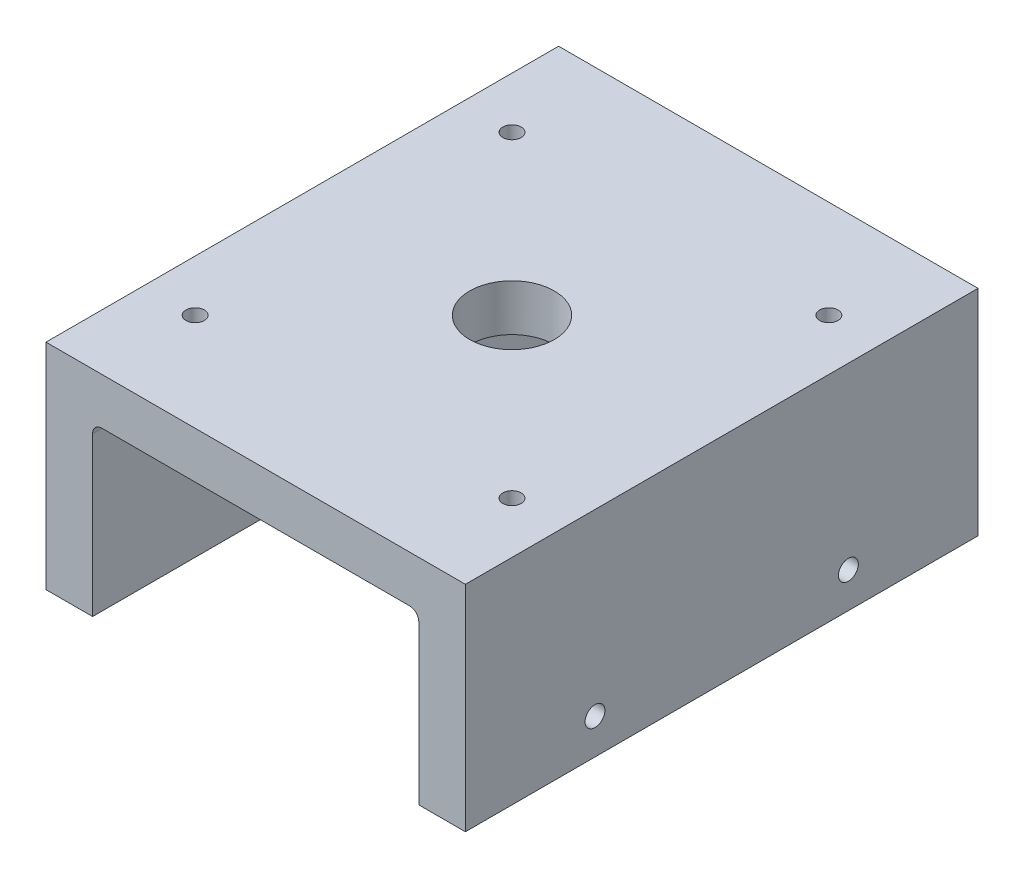
ISO-10303-21;
HEADER;
FILE_DESCRIPTION(('STEP AP214'),'2;1');
FILE_NAME('part.step','',(''),(''),'','','');
FILE_SCHEMA(('AUTOMOTIVE_DESIGN { 1 0 10303 214 1 1 1 1 }'));
ENDSEC;
DATA;
#1=APPLICATION_CONTEXT('core data for automotive mechanical design processes');
#2=APPLICATION_PROTOCOL_DEFINITION('international standard','automotive_design',2000,#1);
#3=PRODUCT_CONTEXT('',#1,'mechanical');
#4=PRODUCT('Part','Part','',(#3));
#5=PRODUCT_RELATED_PRODUCT_CATEGORY('part','',(#4));
#6=PRODUCT_DEFINITION_FORMATION('','',#4);
#7=PRODUCT_DEFINITION_CONTEXT('part definition',#1,'design');
#8=PRODUCT_DEFINITION('design','',#6,#7);
#9=PRODUCT_DEFINITION_SHAPE('','',#8);
#10=(LENGTH_UNIT() NAMED_UNIT(*) SI_UNIT(.MILLI.,.METRE.));
#11=(NAMED_UNIT(*) PLANE_ANGLE_UNIT() SI_UNIT($,.RADIAN.));
#12=(NAMED_UNIT(*) SI_UNIT($,.STERADIAN.) SOLID_ANGLE_UNIT());
#13=UNCERTAINTY_MEASURE_WITH_UNIT(LENGTH_MEASURE(1.E-05),#10,'distance_accuracy_value','');
#14=(GEOMETRIC_REPRESENTATION_CONTEXT(3) GLOBAL_UNCERTAINTY_ASSIGNED_CONTEXT((#13)) GLOBAL_UNIT_ASSIGNED_CONTEXT((#10,
#11,#12)) REPRESENTATION_CONTEXT('',''));
#15=CARTESIAN_POINT('',(0.,0.,0.));
#16=DIRECTION('',(0.,0.,1.));
#17=DIRECTION('',(1.,0.,0.));
#18=AXIS2_PLACEMENT_3D('',#15,#16,#17);
#19=CARTESIAN_POINT('',(-14.9220098279756,-13.5520471219821,69.85));
#20=DIRECTION('',(0.,0.,-1.));
#21=DIRECTION('',(-1.,0.,0.));
#22=AXIS2_PLACEMENT_3D('',#19,#20,#21);
#23=CYLINDRICAL_SURFACE('',#22,1.27);
#24=CARTESIAN_POINT('',(-14.9220098279756,-13.5520471219821,0.));
#25=DIRECTION('',(0.,0.,-1.));
#26=DIRECTION('',(1.,0.,0.));
#27=AXIS2_PLACEMENT_3D('',#24,#25,#26);
#28=CIRCLE('',#27,1.27);
#29=CARTESIAN_POINT('',(-14.9220098279756,-12.2820471219821,0.));
#30=VERTEX_POINT('',#29);
#31=CARTESIAN_POINT('',(-13.6520098279756,-13.5520471219821,0.));
#32=VERTEX_POINT('',#31);
#33=EDGE_CURVE('E142',#30,#32,#28,.T.);
#34=ORIENTED_EDGE('',*,*,#33,.T.);
#35=DIRECTION('',(0.,0.,-1.));
#36=VECTOR('',#35,1.);
#37=CARTESIAN_POINT('',(-13.6520098279756,-13.5520471219821,69.85));
#38=LINE('',#37,#36);
#39=CARTESIAN_POINT('',(-13.6520098279756,-13.5520471219821,69.85));
#40=VERTEX_POINT('',#39);
#41=EDGE_CURVE('E11',#40,#32,#38,.T.);
#42=ORIENTED_EDGE('',*,*,#41,.F.);
#43=CARTESIAN_POINT('',(-14.9220098279756,-13.5520471219821,69.85));
#44=DIRECTION('',(0.,0.,-1.));
#45=DIRECTION('',(1.,0.,0.));
#46=AXIS2_PLACEMENT_3D('',#43,#44,#45);
#47=CIRCLE('',#46,1.27);
#48=CARTESIAN_POINT('',(-14.9220098279756,-12.2820471219821,69.85));
#49=VERTEX_POINT('',#48);
#50=EDGE_CURVE('E160',#49,#40,#47,.T.);
#51=ORIENTED_EDGE('',*,*,#50,.F.);
#52=DIRECTION('',(0.,0.,-1.));
#53=VECTOR('',#52,1.);
#54=CARTESIAN_POINT('',(-14.9220098279756,-12.2820471219821,69.85));
#55=LINE('',#54,#53);
#56=EDGE_CURVE('E138',#49,#30,#55,.T.);
#57=ORIENTED_EDGE('',*,*,#56,.T.);
#58=EDGE_LOOP('',(#34,#42,#51,#57));
#59=FACE_BOUND('',#58,.T.);
#60=ADVANCED_FACE('F30',(#59),#23,.F.);
#61=CARTESIAN_POINT('',(-13.6520098279756,-13.5520471219821,69.85));
#62=DIRECTION('',(1.,0.,0.));
#63=DIRECTION('',(0.,1.,0.));
#64=AXIS2_PLACEMENT_3D('',#61,#62,#63);
#65=PLANE('',#64);
#66=DIRECTION('',(0.,-1.,0.));
#67=VECTOR('',#66,1.);
#68=CARTESIAN_POINT('',(-13.6520098279756,-13.5520471219821,0.));
#69=LINE('',#68,#67);
#70=CARTESIAN_POINT('',(-13.6520098279756,-35.142047121982,0.));
#71=VERTEX_POINT('',#70);
#72=EDGE_CURVE('E145',#32,#71,#69,.T.);
#73=ORIENTED_EDGE('',*,*,#72,.T.);
#74=DIRECTION('',(0.,0.,-1.));
#75=VECTOR('',#74,1.);
#76=CARTESIAN_POINT('',(-13.6520098279756,-35.142047121982,69.85));
#77=LINE('',#76,#75);
#78=CARTESIAN_POINT('',(-13.6520098279756,-35.142047121982,69.85));
#79=VERTEX_POINT('',#78);
#80=EDGE_CURVE('E39',#79,#71,#77,.T.);
#81=ORIENTED_EDGE('',*,*,#80,.F.);
#82=DIRECTION('',(0.,-1.,0.));
#83=VECTOR('',#82,1.);
#84=CARTESIAN_POINT('',(-13.6520098279756,-13.5520471219821,69.85));
#85=LINE('',#84,#83);
#86=EDGE_CURVE('E97',#40,#79,#85,.T.);
#87=ORIENTED_EDGE('',*,*,#86,.F.);
#88=ORIENTED_EDGE('',*,*,#41,.T.);
#89=EDGE_LOOP('',(#73,#81,#87,#88));
#90=FACE_BOUND('',#89,.T.);
#91=ADVANCED_FACE('F308',(#90),#65,.F.);
#92=CARTESIAN_POINT('',(-13.6520098279756,-35.142047121982,69.85));
#93=DIRECTION('',(0.,1.,0.));
#94=DIRECTION('',(0.,0.,1.));
#95=AXIS2_PLACEMENT_3D('',#92,#93,#94);
#96=PLANE('',#95);
#97=DIRECTION('',(1.,0.,0.));
#98=VECTOR('',#97,1.);
#99=CARTESIAN_POINT('',(-13.6520098279756,-35.142047121982,0.));
#100=LINE('',#99,#98);
#101=CARTESIAN_POINT('',(-7.30200982797557,-35.142047121982,0.));
#102=VERTEX_POINT('',#101);
#103=EDGE_CURVE('E147',#71,#102,#100,.T.);
#104=ORIENTED_EDGE('',*,*,#103,.T.);
#105=DIRECTION('',(0.,0.,-1.));
#106=VECTOR('',#105,1.);
#107=CARTESIAN_POINT('',(-7.30200982797557,-35.142047121982,69.85));
#108=LINE('',#107,#106);
#109=CARTESIAN_POINT('',(-7.30200982797557,-35.142047121982,69.85));
#110=VERTEX_POINT('',#109);
#111=EDGE_CURVE('E173',#110,#102,#108,.T.);
#112=ORIENTED_EDGE('',*,*,#111,.F.);
#113=DIRECTION('',(1.,0.,0.));
#114=VECTOR('',#113,1.);
#115=CARTESIAN_POINT('',(-13.6520098279756,-35.142047121982,69.85));
#116=LINE('',#115,#114);
#117=EDGE_CURVE('E182',#79,#110,#116,.T.);
#118=ORIENTED_EDGE('',*,*,#117,.F.);
#119=ORIENTED_EDGE('',*,*,#80,.T.);
#120=EDGE_LOOP('',(#104,#112,#118,#119));
#121=FACE_BOUND('',#120,.T.);
#122=ADVANCED_FACE('F180',(#121),#96,.F.);
#123=CARTESIAN_POINT('',(-7.30200982797557,-35.142047121982,69.85));
#124=DIRECTION('',(-1.,0.,0.));
#125=DIRECTION('',(0.,-1.,0.));
#126=AXIS2_PLACEMENT_3D('',#123,#124,#125);
#127=PLANE('',#126);
#128=CARTESIAN_POINT('',(-7.30200982797557,-30.316047121982,52.1890625));
#129=DIRECTION('',(1.,0.,0.));
#130=DIRECTION('',(0.,0.,-1.));
#131=AXIS2_PLACEMENT_3D('',#128,#129,#130);
#132=CIRCLE('',#131,1.35255);
#133=CARTESIAN_POINT('',(-7.30200982797557,-30.316047121982,50.8365125));
#134=VERTEX_POINT('',#133);
#135=EDGE_CURVE('E280',#134,#134,#132,.T.);
#136=ORIENTED_EDGE('',*,*,#135,.F.);
#137=EDGE_LOOP('',(#136));
#138=FACE_BOUND('',#137,.T.);
#139=CARTESIAN_POINT('',(-7.30200982797557,-30.3160471219821,17.6609375));
#140=DIRECTION('',(1.,0.,0.));
#141=DIRECTION('',(0.,0.,-1.));
#142=AXIS2_PLACEMENT_3D('',#139,#140,#141);
#143=CIRCLE('',#142,1.35255);
#144=CARTESIAN_POINT('',(-7.30200982797557,-30.3160471219821,16.3083875));
#145=VERTEX_POINT('',#144);
#146=EDGE_CURVE('E274',#145,#145,#143,.T.);
#147=ORIENTED_EDGE('',*,*,#146,.F.);
#148=EDGE_LOOP('',(#147));
#149=FACE_BOUND('',#148,.T.);
#150=DIRECTION('',(0.,1.,0.));
#151=VECTOR('',#150,1.);
#152=CARTESIAN_POINT('',(-7.30200982797557,-35.142047121982,0.));
#153=LINE('',#152,#151);
#154=CARTESIAN_POINT('',(-7.30200982797557,-5.93204712198205,0.));
#155=VERTEX_POINT('',#154);
#156=EDGE_CURVE('E149',#102,#155,#153,.T.);
#157=ORIENTED_EDGE('',*,*,#156,.T.);
#158=DIRECTION('',(0.,0.,-1.));
#159=VECTOR('',#158,1.);
#160=CARTESIAN_POINT('',(-7.30200982797557,-5.93204712198205,69.85));
#161=LINE('',#160,#159);
#162=CARTESIAN_POINT('',(-7.30200982797557,-5.93204712198205,69.85));
#163=VERTEX_POINT('',#162);
#164=EDGE_CURVE('E170',#163,#155,#161,.T.);
#165=ORIENTED_EDGE('',*,*,#164,.F.);
#166=DIRECTION('',(0.,1.,0.));
#167=VECTOR('',#166,1.);
#168=CARTESIAN_POINT('',(-7.30200982797557,-35.142047121982,69.85));
#169=LINE('',#168,#167);
#170=EDGE_CURVE('E200',#110,#163,#169,.T.);
#171=ORIENTED_EDGE('',*,*,#170,.F.);
#172=ORIENTED_EDGE('',*,*,#111,.T.);
#173=EDGE_LOOP('',(#157,#165,#171,#172));
#174=FACE_BOUND('',#173,.T.);
#175=ADVANCED_FACE('F191',(#138,#149,#174),#127,.F.);
#176=CARTESIAN_POINT('',(-7.30200982797557,-5.93204712198205,69.85));
#177=DIRECTION('',(0.,-1.,0.));
#178=DIRECTION('',(1.,0.,0.));
#179=AXIS2_PLACEMENT_3D('',#176,#177,#178);
#180=PLANE('',#179);
#181=CARTESIAN_POINT('',(-14.2870098279756,-5.93204712198205,56.515));
#182=DIRECTION('',(0.,1.,0.));
#183=DIRECTION('',(0.,0.,1.));
#184=AXIS2_PLACEMENT_3D('',#181,#182,#183);
#185=CIRCLE('',#184,1.24999999999999);
#186=CARTESIAN_POINT('',(-14.2870098279756,-5.93204712198205,57.765));
#187=VERTEX_POINT('',#186);
#188=EDGE_CURVE('E232',#187,#187,#185,.T.);
#189=ORIENTED_EDGE('',*,*,#188,.F.);
#190=EDGE_LOOP('',(#189));
#191=FACE_BOUND('',#190,.T.);
#192=CARTESIAN_POINT('',(-14.2870098279756,-5.93204712198205,13.335));
#193=DIRECTION('',(0.,1.,0.));
#194=DIRECTION('',(0.,0.,1.));
#195=AXIS2_PLACEMENT_3D('',#192,#193,#194);
#196=CIRCLE('',#195,1.24999999999999);
#197=CARTESIAN_POINT('',(-14.2870098279756,-5.93204712198205,14.585));
#198=VERTEX_POINT('',#197);
#199=EDGE_CURVE('E226',#198,#198,#196,.T.);
#200=ORIENTED_EDGE('',*,*,#199,.F.);
#201=EDGE_LOOP('',(#200));
#202=FACE_BOUND('',#201,.T.);
#203=CARTESIAN_POINT('',(-57.4670098279756,-5.93204712198205,56.515));
#204=DIRECTION('',(0.,1.,0.));
#205=DIRECTION('',(0.,0.,1.));
#206=AXIS2_PLACEMENT_3D('',#203,#204,#205);
#207=CIRCLE('',#206,1.24999999999999);
#208=CARTESIAN_POINT('',(-57.4670098279756,-5.93204712198205,57.765));
#209=VERTEX_POINT('',#208);
#210=EDGE_CURVE('E220',#209,#209,#207,.T.);
#211=ORIENTED_EDGE('',*,*,#210,.F.);
#212=EDGE_LOOP('',(#211));
#213=FACE_BOUND('',#212,.T.);
#214=CARTESIAN_POINT('',(-57.4670098279756,-5.93204712198205,13.335));
#215=DIRECTION('',(0.,1.,0.));
#216=DIRECTION('',(0.,0.,1.));
#217=AXIS2_PLACEMENT_3D('',#214,#215,#216);
#218=CIRCLE('',#217,1.24999999999999);
#219=CARTESIAN_POINT('',(-57.4670098279756,-5.93204712198205,14.585));
#220=VERTEX_POINT('',#219);
#221=EDGE_CURVE('E214',#220,#220,#218,.T.);
#222=ORIENTED_EDGE('',*,*,#221,.F.);
#223=EDGE_LOOP('',(#222));
#224=FACE_BOUND('',#223,.T.);
#225=CARTESIAN_POINT('',(-35.8770098279756,-5.93204712198205,34.925));
#226=DIRECTION('',(0.,1.,0.));
#227=DIRECTION('',(0.,0.,1.));
#228=AXIS2_PLACEMENT_3D('',#225,#226,#227);
#229=CIRCLE('',#228,5.75437);
#230=CARTESIAN_POINT('',(-35.8770098279756,-5.93204712198205,40.67937));
#231=VERTEX_POINT('',#230);
#232=EDGE_CURVE('E208',#231,#231,#229,.T.);
#233=ORIENTED_EDGE('',*,*,#232,.F.);
#234=EDGE_LOOP('',(#233));
#235=FACE_BOUND('',#234,.T.);
#236=DIRECTION('',(-1.,0.,0.));
#237=VECTOR('',#236,1.);
#238=CARTESIAN_POINT('',(-7.30200982797557,-5.93204712198205,0.));
#239=LINE('',#238,#237);
#240=CARTESIAN_POINT('',(-64.4520098279756,-5.93204712198206,0.));
#241=VERTEX_POINT('',#240);
#242=EDGE_CURVE('E151',#155,#241,#239,.T.);
#243=ORIENTED_EDGE('',*,*,#242,.T.);
#244=DIRECTION('',(0.,0.,-1.));
#245=VECTOR('',#244,1.);
#246=CARTESIAN_POINT('',(-64.4520098279756,-5.93204712198206,69.85));
#247=LINE('',#246,#245);
#248=CARTESIAN_POINT('',(-64.4520098279756,-5.93204712198206,69.85));
#249=VERTEX_POINT('',#248);
#250=EDGE_CURVE('E167',#249,#241,#247,.T.);
#251=ORIENTED_EDGE('',*,*,#250,.F.);
#252=DIRECTION('',(-1.,0.,0.));
#253=VECTOR('',#252,1.);
#254=CARTESIAN_POINT('',(-7.30200982797557,-5.93204712198205,69.85));
#255=LINE('',#254,#253);
#256=EDGE_CURVE('E197',#163,#249,#255,.T.);
#257=ORIENTED_EDGE('',*,*,#256,.F.);
#258=ORIENTED_EDGE('',*,*,#164,.T.);
#259=EDGE_LOOP('',(#243,#251,#257,#258));
#260=FACE_BOUND('',#259,.T.);
#261=ADVANCED_FACE('F195',(#191,#202,#213,#224,#235,#260),#180,.F.);
#262=CARTESIAN_POINT('',(-64.4520098279756,-5.93204712198206,69.85));
#263=DIRECTION('',(1.,0.,0.));
#264=DIRECTION('',(0.,0.,-1.));
#265=AXIS2_PLACEMENT_3D('',#262,#263,#264);
#266=PLANE('',#265);
#267=CARTESIAN_POINT('',(-64.4520098279756,-16.8540471219821,19.05));
#268=DIRECTION('',(-1.,0.,0.));
#269=DIRECTION('',(0.,0.,1.));
#270=AXIS2_PLACEMENT_3D('',#267,#268,#269);
#271=CIRCLE('',#270,1.7272);
#272=CARTESIAN_POINT('',(-64.4520098279756,-16.8540471219821,20.7772));
#273=VERTEX_POINT('',#272);
#274=EDGE_CURVE('E268',#273,#273,#271,.T.);
#275=ORIENTED_EDGE('',*,*,#274,.F.);
#276=EDGE_LOOP('',(#275));
#277=FACE_BOUND('',#276,.T.);
#278=CARTESIAN_POINT('',(-64.4520098279756,-16.8540471219821,50.8));
#279=DIRECTION('',(-1.,0.,0.));
#280=DIRECTION('',(0.,0.,1.));
#281=AXIS2_PLACEMENT_3D('',#278,#279,#280);
#282=CIRCLE('',#281,1.7272);
#283=CARTESIAN_POINT('',(-64.4520098279756,-16.8540471219821,52.5272));
#284=VERTEX_POINT('',#283);
#285=EDGE_CURVE('E262',#284,#284,#282,.T.);
#286=ORIENTED_EDGE('',*,*,#285,.F.);
#287=EDGE_LOOP('',(#286));
#288=FACE_BOUND('',#287,.T.);
#289=DIRECTION('',(0.,-1.,0.));
#290=VECTOR('',#289,1.);
#291=CARTESIAN_POINT('',(-64.4520098279756,-5.93204712198206,0.));
#292=LINE('',#291,#290);
#293=CARTESIAN_POINT('',(-64.4520098279756,-35.1420471219821,0.));
#294=VERTEX_POINT('',#293);
#295=EDGE_CURVE('E153',#241,#294,#292,.T.);
#296=ORIENTED_EDGE('',*,*,#295,.T.);
#297=DIRECTION('',(0.,0.,-1.));
#298=VECTOR('',#297,1.);
#299=CARTESIAN_POINT('',(-64.4520098279756,-35.1420471219821,69.85));
#300=LINE('',#299,#298);
#301=CARTESIAN_POINT('',(-64.4520098279756,-35.1420471219821,69.85));
#302=VERTEX_POINT('',#301);
#303=EDGE_CURVE('E164',#302,#294,#300,.T.);
#304=ORIENTED_EDGE('',*,*,#303,.F.);
#305=DIRECTION('',(0.,-1.,0.));
#306=VECTOR('',#305,1.);
#307=CARTESIAN_POINT('',(-64.4520098279756,-5.93204712198206,69.85));
#308=LINE('',#307,#306);
#309=EDGE_CURVE('E199',#249,#302,#308,.T.);
#310=ORIENTED_EDGE('',*,*,#309,.F.);
#311=ORIENTED_EDGE('',*,*,#250,.T.);
#312=EDGE_LOOP('',(#296,#304,#310,#311));
#313=FACE_BOUND('',#312,.T.);
#314=ADVANCED_FACE('F320',(#277,#288,#313),#266,.F.);
#315=CARTESIAN_POINT('',(-64.4520098279756,-35.1420471219821,69.85));
#316=DIRECTION('',(0.,1.,0.));
#317=DIRECTION('',(0.,0.,1.));
#318=AXIS2_PLACEMENT_3D('',#315,#316,#317);
#319=PLANE('',#318);
#320=DIRECTION('',(1.,0.,0.));
#321=VECTOR('',#320,1.);
#322=CARTESIAN_POINT('',(-64.4520098279756,-35.1420471219821,0.));
#323=LINE('',#322,#321);
#324=CARTESIAN_POINT('',(-58.1020098279756,-35.1420471219821,0.));
#325=VERTEX_POINT('',#324);
#326=EDGE_CURVE('E155',#294,#325,#323,.T.);
#327=ORIENTED_EDGE('',*,*,#326,.T.);
#328=DIRECTION('',(0.,0.,-1.));
#329=VECTOR('',#328,1.);
#330=CARTESIAN_POINT('',(-58.1020098279756,-35.1420471219821,69.85));
#331=LINE('',#330,#329);
#332=CARTESIAN_POINT('',(-58.1020098279756,-35.1420471219821,69.85));
#333=VERTEX_POINT('',#332);
#334=EDGE_CURVE('E133',#333,#325,#331,.T.);
#335=ORIENTED_EDGE('',*,*,#334,.F.);
#336=DIRECTION('',(1.,0.,0.));
#337=VECTOR('',#336,1.);
#338=CARTESIAN_POINT('',(-64.4520098279756,-35.1420471219821,69.85));
#339=LINE('',#338,#337);
#340=EDGE_CURVE('E124',#302,#333,#339,.T.);
#341=ORIENTED_EDGE('',*,*,#340,.F.);
#342=ORIENTED_EDGE('',*,*,#303,.T.);
#343=EDGE_LOOP('',(#327,#335,#341,#342));
#344=FACE_BOUND('',#343,.T.);
#345=ADVANCED_FACE('F317',(#344),#319,.F.);
#346=CARTESIAN_POINT('',(-58.1020098279756,-35.1420471219821,69.85));
#347=DIRECTION('',(-1.,0.,0.));
#348=DIRECTION('',(0.,0.,1.));
#349=AXIS2_PLACEMENT_3D('',#346,#347,#348);
#350=PLANE('',#349);
#351=DIRECTION('',(0.,1.,0.));
#352=VECTOR('',#351,1.);
#353=CARTESIAN_POINT('',(-58.1020098279756,-35.1420471219821,0.));
#354=LINE('',#353,#352);
#355=CARTESIAN_POINT('',(-58.1020098279756,-13.5520471219821,0.));
#356=VERTEX_POINT('',#355);
#357=EDGE_CURVE('E132',#325,#356,#354,.T.);
#358=ORIENTED_EDGE('',*,*,#357,.T.);
#359=DIRECTION('',(0.,0.,-1.));
#360=VECTOR('',#359,1.);
#361=CARTESIAN_POINT('',(-58.1020098279756,-13.5520471219821,69.85));
#362=LINE('',#361,#360);
#363=CARTESIAN_POINT('',(-58.1020098279756,-13.5520471219821,69.85));
#364=VERTEX_POINT('',#363);
#365=EDGE_CURVE('E129',#364,#356,#362,.T.);
#366=ORIENTED_EDGE('',*,*,#365,.F.);
#367=DIRECTION('',(0.,1.,0.));
#368=VECTOR('',#367,1.);
#369=CARTESIAN_POINT('',(-58.1020098279756,-35.1420471219821,69.85));
#370=LINE('',#369,#368);
#371=EDGE_CURVE('E118',#333,#364,#370,.T.);
#372=ORIENTED_EDGE('',*,*,#371,.F.);
#373=ORIENTED_EDGE('',*,*,#334,.T.);
#374=EDGE_LOOP('',(#358,#366,#372,#373));
#375=FACE_BOUND('',#374,.T.);
#376=ADVANCED_FACE('F130',(#375),#350,.F.);
#377=CARTESIAN_POINT('',(-56.8320098279756,-13.5520471219821,69.85));
#378=DIRECTION('',(0.,0.,-1.));
#379=DIRECTION('',(-1.,0.,0.));
#380=AXIS2_PLACEMENT_3D('',#377,#378,#379);
#381=CYLINDRICAL_SURFACE('',#380,1.27);
#382=CARTESIAN_POINT('',(-56.8320098279756,-13.5520471219821,0.));
#383=DIRECTION('',(0.,0.,-1.));
#384=DIRECTION('',(-1.,0.,0.));
#385=AXIS2_PLACEMENT_3D('',#382,#383,#384);
#386=CIRCLE('',#385,1.27);
#387=CARTESIAN_POINT('',(-56.8320098279756,-12.282047121982,0.));
#388=VERTEX_POINT('',#387);
#389=EDGE_CURVE('E83',#356,#388,#386,.T.);
#390=ORIENTED_EDGE('',*,*,#389,.T.);
#391=DIRECTION('',(0.,0.,-1.));
#392=VECTOR('',#391,1.);
#393=CARTESIAN_POINT('',(-56.8320098279756,-12.282047121982,69.85));
#394=LINE('',#393,#392);
#395=CARTESIAN_POINT('',(-56.8320098279756,-12.282047121982,69.85));
#396=VERTEX_POINT('',#395);
#397=EDGE_CURVE('E134',#396,#388,#394,.T.);
#398=ORIENTED_EDGE('',*,*,#397,.F.);
#399=CARTESIAN_POINT('',(-56.8320098279756,-13.5520471219821,69.85));
#400=DIRECTION('',(0.,0.,-1.));
#401=DIRECTION('',(-1.,0.,0.));
#402=AXIS2_PLACEMENT_3D('',#399,#400,#401);
#403=CIRCLE('',#402,1.27);
#404=EDGE_CURVE('E122',#364,#396,#403,.T.);
#405=ORIENTED_EDGE('',*,*,#404,.F.);
#406=ORIENTED_EDGE('',*,*,#365,.T.);
#407=EDGE_LOOP('',(#390,#398,#405,#406));
#408=FACE_BOUND('',#407,.T.);
#409=ADVANCED_FACE('F136',(#408),#381,.F.);
#410=CARTESIAN_POINT('',(-56.8320098279756,-12.282047121982,69.85));
#411=DIRECTION('',(0.,1.,0.));
#412=DIRECTION('',(-1.,0.,0.));
#413=AXIS2_PLACEMENT_3D('',#410,#411,#412);
#414=PLANE('',#413);
#415=CARTESIAN_POINT('',(-52.3870098279756,-12.282047121982,64.135));
#416=DIRECTION('',(0.,-1.,0.));
#417=DIRECTION('',(0.,0.,-1.));
#418=AXIS2_PLACEMENT_3D('',#415,#416,#417);
#419=CIRCLE('',#418,1.7272);
#420=CARTESIAN_POINT('',(-52.3870098279756,-12.282047121982,62.4078));
#421=VERTEX_POINT('',#420);
#422=EDGE_CURVE('E256',#421,#421,#419,.T.);
#423=ORIENTED_EDGE('',*,*,#422,.F.);
#424=EDGE_LOOP('',(#423));
#425=FACE_BOUND('',#424,.T.);
#426=CARTESIAN_POINT('',(-19.3670098279756,-12.2820471219821,64.135));
#427=DIRECTION('',(0.,-1.,0.));
#428=DIRECTION('',(0.,0.,-1.));
#429=AXIS2_PLACEMENT_3D('',#426,#427,#428);
#430=CIRCLE('',#429,1.7272);
#431=CARTESIAN_POINT('',(-19.3670098279756,-12.2820471219821,62.4078));
#432=VERTEX_POINT('',#431);
#433=EDGE_CURVE('E250',#432,#432,#430,.T.);
#434=ORIENTED_EDGE('',*,*,#433,.F.);
#435=EDGE_LOOP('',(#434));
#436=FACE_BOUND('',#435,.T.);
#437=CARTESIAN_POINT('',(-52.3870098279756,-12.282047121982,5.71500000000001));
#438=DIRECTION('',(0.,-1.,0.));
#439=DIRECTION('',(0.,0.,-1.));
#440=AXIS2_PLACEMENT_3D('',#437,#438,#439);
#441=CIRCLE('',#440,1.7272);
#442=CARTESIAN_POINT('',(-52.3870098279756,-12.282047121982,3.98780000000001));
#443=VERTEX_POINT('',#442);
#444=EDGE_CURVE('E244',#443,#443,#441,.T.);
#445=ORIENTED_EDGE('',*,*,#444,.F.);
#446=EDGE_LOOP('',(#445));
#447=FACE_BOUND('',#446,.T.);
#448=CARTESIAN_POINT('',(-19.3670098279756,-12.2820471219821,5.71500000000001));
#449=DIRECTION('',(0.,-1.,0.));
#450=DIRECTION('',(0.,0.,-1.));
#451=AXIS2_PLACEMENT_3D('',#448,#449,#450);
#452=CIRCLE('',#451,1.7272);
#453=CARTESIAN_POINT('',(-19.3670098279756,-12.2820471219821,3.98780000000001));
#454=VERTEX_POINT('',#453);
#455=EDGE_CURVE('E238',#454,#454,#452,.T.);
#456=ORIENTED_EDGE('',*,*,#455,.F.);
#457=EDGE_LOOP('',(#456));
#458=FACE_BOUND('',#457,.T.);
#459=CARTESIAN_POINT('',(-35.8770098279756,-12.282047121982,34.925));
#460=DIRECTION('',(0.,1.,0.));
#461=DIRECTION('',(-1.,0.,0.));
#462=AXIS2_PLACEMENT_3D('',#459,#460,#461);
#463=CIRCLE('',#462,5.75437);
#464=CARTESIAN_POINT('',(-41.6313798279756,-12.282047121982,34.925));
#465=VERTEX_POINT('',#464);
#466=EDGE_CURVE('E33',#465,#465,#463,.T.);
#467=ORIENTED_EDGE('',*,*,#466,.T.);
#468=EDGE_LOOP('',(#467));
#469=FACE_BOUND('',#468,.T.);
#470=DIRECTION('',(1.,0.,0.));
#471=VECTOR('',#470,1.);
#472=CARTESIAN_POINT('',(-56.8320098279756,-12.282047121982,0.));
#473=LINE('',#472,#471);
#474=EDGE_CURVE('E89',#388,#30,#473,.T.);
#475=ORIENTED_EDGE('',*,*,#474,.T.);
#476=ORIENTED_EDGE('',*,*,#56,.F.);
#477=DIRECTION('',(1.,0.,0.));
#478=VECTOR('',#477,1.);
#479=CARTESIAN_POINT('',(-56.8320098279756,-12.282047121982,69.85));
#480=LINE('',#479,#478);
#481=EDGE_CURVE('E47',#396,#49,#480,.T.);
#482=ORIENTED_EDGE('',*,*,#481,.F.);
#483=ORIENTED_EDGE('',*,*,#397,.T.);
#484=EDGE_LOOP('',(#475,#476,#482,#483));
#485=FACE_BOUND('',#484,.T.);
#486=ADVANCED_FACE('F426',(#425,#436,#447,#458,#469,#485),#414,.F.);
#487=CARTESIAN_POINT('',(-14.9220098279756,-13.5520471219821,69.85));
#488=DIRECTION('',(0.,0.,1.));
#489=DIRECTION('',(1.,0.,0.));
#490=AXIS2_PLACEMENT_3D('',#487,#488,#489);
#491=PLANE('',#490);
#492=ORIENTED_EDGE('',*,*,#50,.T.);
#493=ORIENTED_EDGE('',*,*,#86,.T.);
#494=ORIENTED_EDGE('',*,*,#117,.T.);
#495=ORIENTED_EDGE('',*,*,#170,.T.);
#496=ORIENTED_EDGE('',*,*,#256,.T.);
#497=ORIENTED_EDGE('',*,*,#309,.T.);
#498=ORIENTED_EDGE('',*,*,#340,.T.);
#499=ORIENTED_EDGE('',*,*,#371,.T.);
#500=ORIENTED_EDGE('',*,*,#404,.T.);
#501=ORIENTED_EDGE('',*,*,#481,.T.);
#502=EDGE_LOOP('',(#492,#493,#494,#495,#496,#497,#498,#499,#500,#501));
#503=FACE_BOUND('',#502,.T.);
#504=ADVANCED_FACE('F120',(#503),#491,.T.);
#505=CARTESIAN_POINT('',(-14.9220098279756,-13.5520471219821,0.));
#506=DIRECTION('',(0.,0.,1.));
#507=DIRECTION('',(1.,0.,0.));
#508=AXIS2_PLACEMENT_3D('',#505,#506,#507);
#509=PLANE('',#508);
#510=ORIENTED_EDGE('',*,*,#33,.F.);
#511=ORIENTED_EDGE('',*,*,#474,.F.);
#512=ORIENTED_EDGE('',*,*,#389,.F.);
#513=ORIENTED_EDGE('',*,*,#357,.F.);
#514=ORIENTED_EDGE('',*,*,#326,.F.);
#515=ORIENTED_EDGE('',*,*,#295,.F.);
#516=ORIENTED_EDGE('',*,*,#242,.F.);
#517=ORIENTED_EDGE('',*,*,#156,.F.);
#518=ORIENTED_EDGE('',*,*,#103,.F.);
#519=ORIENTED_EDGE('',*,*,#72,.F.);
#520=EDGE_LOOP('',(#510,#511,#512,#513,#514,#515,#516,#517,#518,#519));
#521=FACE_BOUND('',#520,.T.);
#522=ADVANCED_FACE('F186',(#521),#509,.F.);
#523=CARTESIAN_POINT('',(-35.8770098279756,-5.93204712198205,34.925));
#524=DIRECTION('',(0.,1.,0.));
#525=DIRECTION('',(0.,0.,1.));
#526=AXIS2_PLACEMENT_3D('',#523,#524,#525);
#527=CYLINDRICAL_SURFACE('',#526,5.75437);
#528=ORIENTED_EDGE('',*,*,#232,.T.);
#529=EDGE_LOOP('',(#528));
#530=FACE_BOUND('',#529,.T.);
#531=ORIENTED_EDGE('',*,*,#466,.F.);
#532=EDGE_LOOP('',(#531));
#533=FACE_BOUND('',#532,.T.);
#534=ADVANCED_FACE('F592',(#530,#533),#527,.F.);
#535=CARTESIAN_POINT('',(-57.4670098279756,-9.23404712198206,13.335));
#536=DIRECTION('',(0.,1.,0.));
#537=DIRECTION('',(0.,0.,1.));
#538=AXIS2_PLACEMENT_3D('',#535,#536,#537);
#539=CONICAL_SURFACE('',#538,1.25,1.02974425867666);
#540=CARTESIAN_POINT('',(-57.4670098279756,-9.98512289576651,13.335));
#541=VERTEX_POINT('',#540);
#542=VERTEX_LOOP('',#541);
#543=FACE_BOUND('',#542,.T.);
#544=CARTESIAN_POINT('',(-57.4670098279756,-9.23404712198206,13.335));
#545=DIRECTION('',(0.,1.,0.));
#546=DIRECTION('',(0.,0.,1.));
#547=AXIS2_PLACEMENT_3D('',#544,#545,#546);
#548=CIRCLE('',#547,1.25);
#549=CARTESIAN_POINT('',(-57.4670098279756,-9.23404712198206,14.585));
#550=VERTEX_POINT('',#549);
#551=EDGE_CURVE('E211',#550,#550,#548,.T.);
#552=ORIENTED_EDGE('',*,*,#551,.T.);
#553=EDGE_LOOP('',(#552));
#554=FACE_BOUND('',#553,.T.);
#555=ADVANCED_FACE('F588',(#543,#554),#539,.F.);
#556=CARTESIAN_POINT('',(-57.4670098279756,-5.93204712198206,13.335));
#557=DIRECTION('',(0.,1.,0.));
#558=DIRECTION('',(0.,0.,1.));
#559=AXIS2_PLACEMENT_3D('',#556,#557,#558);
#560=CYLINDRICAL_SURFACE('',#559,1.24999999999999);
#561=ORIENTED_EDGE('',*,*,#551,.F.);
#562=EDGE_LOOP('',(#561));
#563=FACE_BOUND('',#562,.T.);
#564=ORIENTED_EDGE('',*,*,#221,.T.);
#565=EDGE_LOOP('',(#564));
#566=FACE_BOUND('',#565,.T.);
#567=ADVANCED_FACE('F358',(#563,#566),#560,.F.);
#568=CARTESIAN_POINT('',(-57.4670098279756,-9.23404712198206,56.515));
#569=DIRECTION('',(0.,1.,0.));
#570=DIRECTION('',(0.,0.,1.));
#571=AXIS2_PLACEMENT_3D('',#568,#569,#570);
#572=CONICAL_SURFACE('',#571,1.25,1.02974425867666);
#573=CARTESIAN_POINT('',(-57.4670098279756,-9.98512289576651,56.515));
#574=VERTEX_POINT('',#573);
#575=VERTEX_LOOP('',#574);
#576=FACE_BOUND('',#575,.T.);
#577=CARTESIAN_POINT('',(-57.4670098279756,-9.23404712198206,56.515));
#578=DIRECTION('',(0.,1.,0.));
#579=DIRECTION('',(0.,0.,1.));
#580=AXIS2_PLACEMENT_3D('',#577,#578,#579);
#581=CIRCLE('',#580,1.25);
#582=CARTESIAN_POINT('',(-57.4670098279756,-9.23404712198206,57.765));
#583=VERTEX_POINT('',#582);
#584=EDGE_CURVE('E217',#583,#583,#581,.T.);
#585=ORIENTED_EDGE('',*,*,#584,.T.);
#586=EDGE_LOOP('',(#585));
#587=FACE_BOUND('',#586,.T.);
#588=ADVANCED_FACE('F363',(#576,#587),#572,.F.);
#589=CARTESIAN_POINT('',(-57.4670098279756,-5.93204712198206,56.515));
#590=DIRECTION('',(0.,1.,0.));
#591=DIRECTION('',(0.,0.,1.));
#592=AXIS2_PLACEMENT_3D('',#589,#590,#591);
#593=CYLINDRICAL_SURFACE('',#592,1.24999999999999);
#594=ORIENTED_EDGE('',*,*,#584,.F.);
#595=EDGE_LOOP('',(#594));
#596=FACE_BOUND('',#595,.T.);
#597=ORIENTED_EDGE('',*,*,#210,.T.);
#598=EDGE_LOOP('',(#597));
#599=FACE_BOUND('',#598,.T.);
#600=ADVANCED_FACE('F368',(#596,#599),#593,.F.);
#601=CARTESIAN_POINT('',(-14.2870098279756,-9.23404712198205,13.335));
#602=DIRECTION('',(0.,1.,0.));
#603=DIRECTION('',(0.,0.,1.));
#604=AXIS2_PLACEMENT_3D('',#601,#602,#603);
#605=CONICAL_SURFACE('',#604,1.25,1.02974425867665);
#606=CARTESIAN_POINT('',(-14.2870098279756,-9.9851228957665,13.335));
#607=VERTEX_POINT('',#606);
#608=VERTEX_LOOP('',#607);
#609=FACE_BOUND('',#608,.T.);
#610=CARTESIAN_POINT('',(-14.2870098279756,-9.23404712198205,13.335));
#611=DIRECTION('',(0.,1.,0.));
#612=DIRECTION('',(0.,0.,1.));
#613=AXIS2_PLACEMENT_3D('',#610,#611,#612);
#614=CIRCLE('',#613,1.25);
#615=CARTESIAN_POINT('',(-14.2870098279756,-9.23404712198205,14.585));
#616=VERTEX_POINT('',#615);
#617=EDGE_CURVE('E223',#616,#616,#614,.T.);
#618=ORIENTED_EDGE('',*,*,#617,.T.);
#619=EDGE_LOOP('',(#618));
#620=FACE_BOUND('',#619,.T.);
#621=ADVANCED_FACE('F378',(#609,#620),#605,.F.);
#622=CARTESIAN_POINT('',(-14.2870098279756,-5.93204712198205,13.335));
#623=DIRECTION('',(0.,1.,0.));
#624=DIRECTION('',(0.,0.,1.));
#625=AXIS2_PLACEMENT_3D('',#622,#623,#624);
#626=CYLINDRICAL_SURFACE('',#625,1.24999999999999);
#627=ORIENTED_EDGE('',*,*,#617,.F.);
#628=EDGE_LOOP('',(#627));
#629=FACE_BOUND('',#628,.T.);
#630=ORIENTED_EDGE('',*,*,#199,.T.);
#631=EDGE_LOOP('',(#630));
#632=FACE_BOUND('',#631,.T.);
#633=ADVANCED_FACE('F388',(#629,#632),#626,.F.);
#634=CARTESIAN_POINT('',(-14.2870098279756,-9.23404712198205,56.515));
#635=DIRECTION('',(0.,1.,0.));
#636=DIRECTION('',(0.,0.,1.));
#637=AXIS2_PLACEMENT_3D('',#634,#635,#636);
#638=CONICAL_SURFACE('',#637,1.25,1.02974425867665);
#639=CARTESIAN_POINT('',(-14.2870098279756,-9.9851228957665,56.515));
#640=VERTEX_POINT('',#639);
#641=VERTEX_LOOP('',#640);
#642=FACE_BOUND('',#641,.T.);
#643=CARTESIAN_POINT('',(-14.2870098279756,-9.23404712198205,56.515));
#644=DIRECTION('',(0.,1.,0.));
#645=DIRECTION('',(0.,0.,1.));
#646=AXIS2_PLACEMENT_3D('',#643,#644,#645);
#647=CIRCLE('',#646,1.25);
#648=CARTESIAN_POINT('',(-14.2870098279756,-9.23404712198205,57.765));
#649=VERTEX_POINT('',#648);
#650=EDGE_CURVE('E229',#649,#649,#647,.T.);
#651=ORIENTED_EDGE('',*,*,#650,.T.);
#652=EDGE_LOOP('',(#651));
#653=FACE_BOUND('',#652,.T.);
#654=ADVANCED_FACE('F398',(#642,#653),#638,.F.);
#655=CARTESIAN_POINT('',(-14.2870098279756,-5.93204712198205,56.515));
#656=DIRECTION('',(0.,1.,0.));
#657=DIRECTION('',(0.,0.,1.));
#658=AXIS2_PLACEMENT_3D('',#655,#656,#657);
#659=CYLINDRICAL_SURFACE('',#658,1.24999999999999);
#660=ORIENTED_EDGE('',*,*,#650,.F.);
#661=EDGE_LOOP('',(#660));
#662=FACE_BOUND('',#661,.T.);
#663=ORIENTED_EDGE('',*,*,#188,.T.);
#664=EDGE_LOOP('',(#663));
#665=FACE_BOUND('',#664,.T.);
#666=ADVANCED_FACE('F408',(#662,#665),#659,.F.);
#667=CARTESIAN_POINT('',(-19.3670098279756,-7.45604712198205,5.71500000000001));
#668=DIRECTION('',(0.,-1.,0.));
#669=DIRECTION('',(0.,0.,-1.));
#670=AXIS2_PLACEMENT_3D('',#667,#668,#669);
#671=CONICAL_SURFACE('',#670,1.7272,1.02974425867665);
#672=CARTESIAN_POINT('',(-19.3670098279756,-6.41824066079765,5.71500000000001));
#673=VERTEX_POINT('',#672);
#674=VERTEX_LOOP('',#673);
#675=FACE_BOUND('',#674,.T.);
#676=CARTESIAN_POINT('',(-19.3670098279756,-7.45604712198205,5.71500000000001));
#677=DIRECTION('',(0.,-1.,0.));
#678=DIRECTION('',(0.,0.,-1.));
#679=AXIS2_PLACEMENT_3D('',#676,#677,#678);
#680=CIRCLE('',#679,1.7272);
#681=CARTESIAN_POINT('',(-19.3670098279756,-7.45604712198205,3.98780000000001));
#682=VERTEX_POINT('',#681);
#683=EDGE_CURVE('E235',#682,#682,#680,.T.);
#684=ORIENTED_EDGE('',*,*,#683,.T.);
#685=EDGE_LOOP('',(#684));
#686=FACE_BOUND('',#685,.T.);
#687=ADVANCED_FACE('F418',(#675,#686),#671,.F.);
#688=CARTESIAN_POINT('',(-19.3670098279756,-12.2820471219821,5.71500000000001));
#689=DIRECTION('',(0.,-1.,0.));
#690=DIRECTION('',(0.,0.,-1.));
#691=AXIS2_PLACEMENT_3D('',#688,#689,#690);
#692=CYLINDRICAL_SURFACE('',#691,1.7272);
#693=ORIENTED_EDGE('',*,*,#683,.F.);
#694=EDGE_LOOP('',(#693));
#695=FACE_BOUND('',#694,.T.);
#696=ORIENTED_EDGE('',*,*,#455,.T.);
#697=EDGE_LOOP('',(#696));
#698=FACE_BOUND('',#697,.T.);
#699=ADVANCED_FACE('F442',(#695,#698),#692,.F.);
#700=CARTESIAN_POINT('',(-52.3870098279756,-7.45604712198205,5.71500000000001));
#701=DIRECTION('',(0.,-1.,0.));
#702=DIRECTION('',(0.,0.,-1.));
#703=AXIS2_PLACEMENT_3D('',#700,#701,#702);
#704=CONICAL_SURFACE('',#703,1.7272,1.02974425867665);
#705=CARTESIAN_POINT('',(-52.3870098279756,-6.41824066079765,5.71500000000001));
#706=VERTEX_POINT('',#705);
#707=VERTEX_LOOP('',#706);
#708=FACE_BOUND('',#707,.T.);
#709=CARTESIAN_POINT('',(-52.3870098279756,-7.45604712198205,5.71500000000001));
#710=DIRECTION('',(0.,-1.,0.));
#711=DIRECTION('',(0.,0.,-1.));
#712=AXIS2_PLACEMENT_3D('',#709,#710,#711);
#713=CIRCLE('',#712,1.7272);
#714=CARTESIAN_POINT('',(-52.3870098279756,-7.45604712198205,3.98780000000001));
#715=VERTEX_POINT('',#714);
#716=EDGE_CURVE('E241',#715,#715,#713,.T.);
#717=ORIENTED_EDGE('',*,*,#716,.T.);
#718=EDGE_LOOP('',(#717));
#719=FACE_BOUND('',#718,.T.);
#720=ADVANCED_FACE('F452',(#708,#719),#704,.F.);
#721=CARTESIAN_POINT('',(-52.3870098279756,-12.282047121982,5.71500000000001));
#722=DIRECTION('',(0.,-1.,0.));
#723=DIRECTION('',(0.,0.,-1.));
#724=AXIS2_PLACEMENT_3D('',#721,#722,#723);
#725=CYLINDRICAL_SURFACE('',#724,1.7272);
#726=ORIENTED_EDGE('',*,*,#716,.F.);
#727=EDGE_LOOP('',(#726));
#728=FACE_BOUND('',#727,.T.);
#729=ORIENTED_EDGE('',*,*,#444,.T.);
#730=EDGE_LOOP('',(#729));
#731=FACE_BOUND('',#730,.T.);
#732=ADVANCED_FACE('F462',(#728,#731),#725,.F.);
#733=CARTESIAN_POINT('',(-19.3670098279756,-7.45604712198205,64.135));
#734=DIRECTION('',(0.,-1.,0.));
#735=DIRECTION('',(0.,0.,-1.));
#736=AXIS2_PLACEMENT_3D('',#733,#734,#735);
#737=CONICAL_SURFACE('',#736,1.7272,1.02974425867665);
#738=CARTESIAN_POINT('',(-19.3670098279756,-6.41824066079765,64.135));
#739=VERTEX_POINT('',#738);
#740=VERTEX_LOOP('',#739);
#741=FACE_BOUND('',#740,.T.);
#742=CARTESIAN_POINT('',(-19.3670098279756,-7.45604712198205,64.135));
#743=DIRECTION('',(0.,-1.,0.));
#744=DIRECTION('',(0.,0.,-1.));
#745=AXIS2_PLACEMENT_3D('',#742,#743,#744);
#746=CIRCLE('',#745,1.7272);
#747=CARTESIAN_POINT('',(-19.3670098279756,-7.45604712198205,62.4078));
#748=VERTEX_POINT('',#747);
#749=EDGE_CURVE('E247',#748,#748,#746,.T.);
#750=ORIENTED_EDGE('',*,*,#749,.T.);
#751=EDGE_LOOP('',(#750));
#752=FACE_BOUND('',#751,.T.);
#753=ADVANCED_FACE('F472',(#741,#752),#737,.F.);
#754=CARTESIAN_POINT('',(-19.3670098279756,-12.2820471219821,64.135));
#755=DIRECTION('',(0.,-1.,0.));
#756=DIRECTION('',(0.,0.,-1.));
#757=AXIS2_PLACEMENT_3D('',#754,#755,#756);
#758=CYLINDRICAL_SURFACE('',#757,1.7272);
#759=ORIENTED_EDGE('',*,*,#749,.F.);
#760=EDGE_LOOP('',(#759));
#761=FACE_BOUND('',#760,.T.);
#762=ORIENTED_EDGE('',*,*,#433,.T.);
#763=EDGE_LOOP('',(#762));
#764=FACE_BOUND('',#763,.T.);
#765=ADVANCED_FACE('F482',(#761,#764),#758,.F.);
#766=CARTESIAN_POINT('',(-52.3870098279756,-7.45604712198205,64.135));
#767=DIRECTION('',(0.,-1.,0.));
#768=DIRECTION('',(0.,0.,-1.));
#769=AXIS2_PLACEMENT_3D('',#766,#767,#768);
#770=CONICAL_SURFACE('',#769,1.7272,1.02974425867665);
#771=CARTESIAN_POINT('',(-52.3870098279756,-6.41824066079765,64.135));
#772=VERTEX_POINT('',#771);
#773=VERTEX_LOOP('',#772);
#774=FACE_BOUND('',#773,.T.);
#775=CARTESIAN_POINT('',(-52.3870098279756,-7.45604712198205,64.135));
#776=DIRECTION('',(0.,-1.,0.));
#777=DIRECTION('',(0.,0.,-1.));
#778=AXIS2_PLACEMENT_3D('',#775,#776,#777);
#779=CIRCLE('',#778,1.7272);
#780=CARTESIAN_POINT('',(-52.3870098279756,-7.45604712198205,62.4078));
#781=VERTEX_POINT('',#780);
#782=EDGE_CURVE('E253',#781,#781,#779,.T.);
#783=ORIENTED_EDGE('',*,*,#782,.T.);
#784=EDGE_LOOP('',(#783));
#785=FACE_BOUND('',#784,.T.);
#786=ADVANCED_FACE('F492',(#774,#785),#770,.F.);
#787=CARTESIAN_POINT('',(-52.3870098279756,-12.282047121982,64.135));
#788=DIRECTION('',(0.,-1.,0.));
#789=DIRECTION('',(0.,0.,-1.));
#790=AXIS2_PLACEMENT_3D('',#787,#788,#789);
#791=CYLINDRICAL_SURFACE('',#790,1.7272);
#792=ORIENTED_EDGE('',*,*,#782,.F.);
#793=EDGE_LOOP('',(#792));
#794=FACE_BOUND('',#793,.T.);
#795=ORIENTED_EDGE('',*,*,#422,.T.);
#796=EDGE_LOOP('',(#795));
#797=FACE_BOUND('',#796,.T.);
#798=ADVANCED_FACE('F502',(#794,#797),#791,.F.);
#799=CARTESIAN_POINT('',(-60.3880098279756,-16.8540471219821,50.8));
#800=DIRECTION('',(-1.,0.,0.));
#801=DIRECTION('',(0.,0.,1.));
#802=AXIS2_PLACEMENT_3D('',#799,#800,#801);
#803=CONICAL_SURFACE('',#802,1.7272,1.02974425867665);
#804=CARTESIAN_POINT('',(-59.3502033667912,-16.8540471219821,50.8));
#805=VERTEX_POINT('',#804);
#806=VERTEX_LOOP('',#805);
#807=FACE_BOUND('',#806,.T.);
#808=CARTESIAN_POINT('',(-60.3880098279756,-16.8540471219821,50.8));
#809=DIRECTION('',(-1.,0.,0.));
#810=DIRECTION('',(0.,0.,1.));
#811=AXIS2_PLACEMENT_3D('',#808,#809,#810);
#812=CIRCLE('',#811,1.7272);
#813=CARTESIAN_POINT('',(-60.3880098279756,-16.8540471219821,52.5272));
#814=VERTEX_POINT('',#813);
#815=EDGE_CURVE('E259',#814,#814,#812,.T.);
#816=ORIENTED_EDGE('',*,*,#815,.T.);
#817=EDGE_LOOP('',(#816));
#818=FACE_BOUND('',#817,.T.);
#819=ADVANCED_FACE('F511',(#807,#818),#803,.F.);
#820=CARTESIAN_POINT('',(-64.4520098279756,-16.8540471219821,50.8));
#821=DIRECTION('',(-1.,0.,0.));
#822=DIRECTION('',(0.,0.,1.));
#823=AXIS2_PLACEMENT_3D('',#820,#821,#822);
#824=CYLINDRICAL_SURFACE('',#823,1.7272);
#825=ORIENTED_EDGE('',*,*,#815,.F.);
#826=EDGE_LOOP('',(#825));
#827=FACE_BOUND('',#826,.T.);
#828=ORIENTED_EDGE('',*,*,#285,.T.);
#829=EDGE_LOOP('',(#828));
#830=FACE_BOUND('',#829,.T.);
#831=ADVANCED_FACE('F526',(#827,#830),#824,.F.);
#832=CARTESIAN_POINT('',(-60.3880098279756,-16.8540471219821,19.05));
#833=DIRECTION('',(-1.,0.,0.));
#834=DIRECTION('',(0.,0.,1.));
#835=AXIS2_PLACEMENT_3D('',#832,#833,#834);
#836=CONICAL_SURFACE('',#835,1.7272,1.02974425867665);
#837=CARTESIAN_POINT('',(-59.3502033667912,-16.8540471219821,19.05));
#838=VERTEX_POINT('',#837);
#839=VERTEX_LOOP('',#838);
#840=FACE_BOUND('',#839,.T.);
#841=CARTESIAN_POINT('',(-60.3880098279756,-16.8540471219821,19.05));
#842=DIRECTION('',(-1.,0.,0.));
#843=DIRECTION('',(0.,0.,1.));
#844=AXIS2_PLACEMENT_3D('',#841,#842,#843);
#845=CIRCLE('',#844,1.7272);
#846=CARTESIAN_POINT('',(-60.3880098279756,-16.8540471219821,20.7772));
#847=VERTEX_POINT('',#846);
#848=EDGE_CURVE('E265',#847,#847,#845,.T.);
#849=ORIENTED_EDGE('',*,*,#848,.T.);
#850=EDGE_LOOP('',(#849));
#851=FACE_BOUND('',#850,.T.);
#852=ADVANCED_FACE('F536',(#840,#851),#836,.F.);
#853=CARTESIAN_POINT('',(-64.4520098279756,-16.8540471219821,19.05));
#854=DIRECTION('',(-1.,0.,0.));
#855=DIRECTION('',(0.,0.,1.));
#856=AXIS2_PLACEMENT_3D('',#853,#854,#855);
#857=CYLINDRICAL_SURFACE('',#856,1.7272);
#858=ORIENTED_EDGE('',*,*,#848,.F.);
#859=EDGE_LOOP('',(#858));
#860=FACE_BOUND('',#859,.T.);
#861=ORIENTED_EDGE('',*,*,#274,.T.);
#862=EDGE_LOOP('',(#861));
#863=FACE_BOUND('',#862,.T.);
#864=ADVANCED_FACE('F303',(#860,#863),#857,.F.);
#865=CARTESIAN_POINT('',(-12.3820098279756,-30.3160471219821,17.6609375));
#866=DIRECTION('',(1.,0.,0.));
#867=DIRECTION('',(0.,0.,-1.));
#868=AXIS2_PLACEMENT_3D('',#865,#866,#867);
#869=CONICAL_SURFACE('',#868,1.35255,1.02974425867665);
#870=CARTESIAN_POINT('',(-13.1947038582413,-30.3160471219821,17.6609375));
#871=VERTEX_POINT('',#870);
#872=VERTEX_LOOP('',#871);
#873=FACE_BOUND('',#872,.T.);
#874=CARTESIAN_POINT('',(-12.3820098279756,-30.3160471219821,17.6609375));
#875=DIRECTION('',(1.,0.,0.));
#876=DIRECTION('',(0.,0.,-1.));
#877=AXIS2_PLACEMENT_3D('',#874,#875,#876);
#878=CIRCLE('',#877,1.35255);
#879=CARTESIAN_POINT('',(-12.3820098279756,-30.3160471219821,16.3083875));
#880=VERTEX_POINT('',#879);
#881=EDGE_CURVE('E271',#880,#880,#878,.T.);
#882=ORIENTED_EDGE('',*,*,#881,.T.);
#883=EDGE_LOOP('',(#882));
#884=FACE_BOUND('',#883,.T.);
#885=ADVANCED_FACE('F294',(#873,#884),#869,.F.);
#886=CARTESIAN_POINT('',(-7.30200982797557,-30.3160471219821,17.6609375));
#887=DIRECTION('',(1.,0.,0.));
#888=DIRECTION('',(0.,0.,-1.));
#889=AXIS2_PLACEMENT_3D('',#886,#887,#888);
#890=CYLINDRICAL_SURFACE('',#889,1.35255);
#891=ORIENTED_EDGE('',*,*,#881,.F.);
#892=EDGE_LOOP('',(#891));
#893=FACE_BOUND('',#892,.T.);
#894=ORIENTED_EDGE('',*,*,#146,.T.);
#895=EDGE_LOOP('',(#894));
#896=FACE_BOUND('',#895,.T.);
#897=ADVANCED_FACE('F291',(#893,#896),#890,.F.);
#898=CARTESIAN_POINT('',(-12.3820098279756,-30.316047121982,52.1890625));
#899=DIRECTION('',(1.,0.,0.));
#900=DIRECTION('',(0.,0.,-1.));
#901=AXIS2_PLACEMENT_3D('',#898,#899,#900);
#902=CONICAL_SURFACE('',#901,1.35255,1.02974425867665);
#903=CARTESIAN_POINT('',(-13.1947038582413,-30.316047121982,52.1890625));
#904=VERTEX_POINT('',#903);
#905=VERTEX_LOOP('',#904);
#906=FACE_BOUND('',#905,.T.);
#907=CARTESIAN_POINT('',(-12.3820098279756,-30.316047121982,52.1890625));
#908=DIRECTION('',(1.,0.,0.));
#909=DIRECTION('',(0.,0.,-1.));
#910=AXIS2_PLACEMENT_3D('',#907,#908,#909);
#911=CIRCLE('',#910,1.35255);
#912=CARTESIAN_POINT('',(-12.3820098279756,-30.316047121982,50.8365125));
#913=VERTEX_POINT('',#912);
#914=EDGE_CURVE('E277',#913,#913,#911,.T.);
#915=ORIENTED_EDGE('',*,*,#914,.T.);
#916=EDGE_LOOP('',(#915));
#917=FACE_BOUND('',#916,.T.);
#918=ADVANCED_FACE('F293',(#906,#917),#902,.F.);
#919=CARTESIAN_POINT('',(-7.30200982797557,-30.316047121982,52.1890625));
#920=DIRECTION('',(1.,0.,0.));
#921=DIRECTION('',(0.,0.,-1.));
#922=AXIS2_PLACEMENT_3D('',#919,#920,#921);
#923=CYLINDRICAL_SURFACE('',#922,1.35255);
#924=ORIENTED_EDGE('',*,*,#914,.F.);
#925=EDGE_LOOP('',(#924));
#926=FACE_BOUND('',#925,.T.);
#927=ORIENTED_EDGE('',*,*,#135,.T.);
#928=EDGE_LOOP('',(#927));
#929=FACE_BOUND('',#928,.T.);
#930=ADVANCED_FACE('F284',(#926,#929),#923,.F.);
#931=CLOSED_SHELL('',(#60,#91,#122,#175,#261,#314,#345,#376,#409,#486,#504,#522,#534,#555,#567,
#588,#600,#621,#633,#654,#666,#687,#699,#720,#732,#753,#765,#786,#798,#819,#831,#852,#864,#885,
#897,#918,#930));
#932=MANIFOLD_SOLID_BREP('B2',#931);
#933=ADVANCED_BREP_SHAPE_REPRESENTATION('',(#18,#932),#14);
#934=SHAPE_DEFINITION_REPRESENTATION(#9,#933);
ENDSEC;
END-ISO-10303-21;
